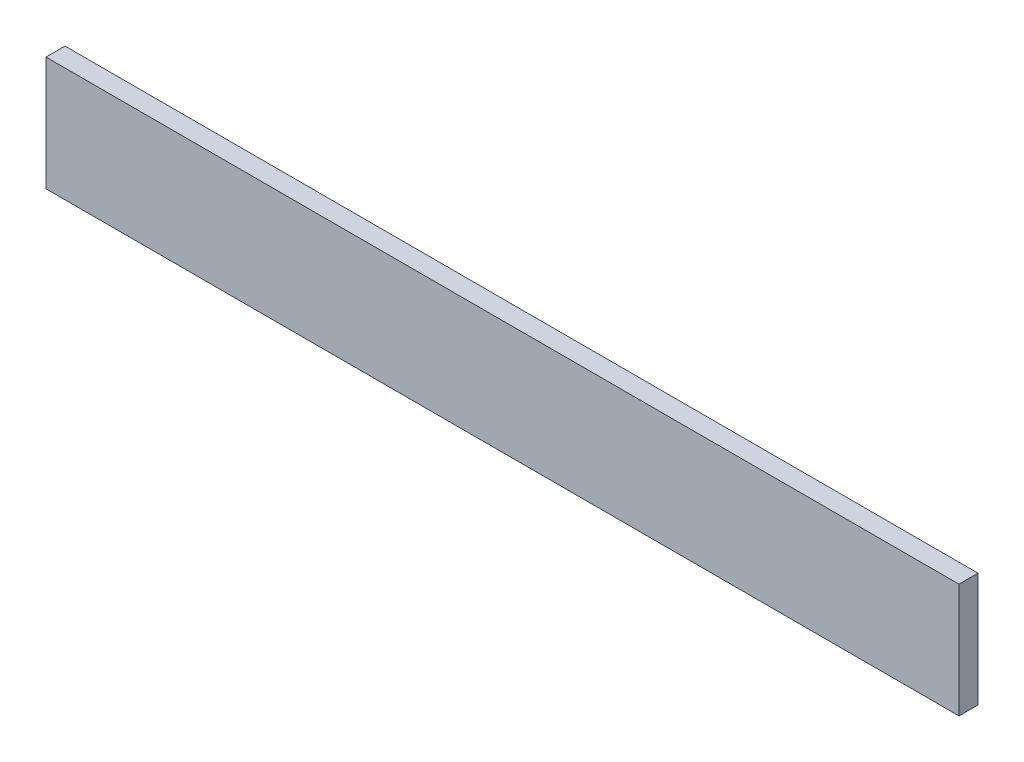
ISO-10303-21;
HEADER;
FILE_DESCRIPTION(('STEP AP214'),'2;1');
FILE_NAME('part.step','',(''),(''),'','','');
FILE_SCHEMA(('AUTOMOTIVE_DESIGN { 1 0 10303 214 1 1 1 1 }'));
ENDSEC;
DATA;
#1=APPLICATION_CONTEXT('core data for automotive mechanical design processes');
#2=APPLICATION_PROTOCOL_DEFINITION('international standard','automotive_design',2000,#1);
#3=PRODUCT_CONTEXT('',#1,'mechanical');
#4=PRODUCT('Part','Part','',(#3));
#5=PRODUCT_RELATED_PRODUCT_CATEGORY('part','',(#4));
#6=PRODUCT_DEFINITION_FORMATION('','',#4);
#7=PRODUCT_DEFINITION_CONTEXT('part definition',#1,'design');
#8=PRODUCT_DEFINITION('design','',#6,#7);
#9=PRODUCT_DEFINITION_SHAPE('','',#8);
#10=(LENGTH_UNIT() NAMED_UNIT(*) SI_UNIT(.MILLI.,.METRE.));
#11=(NAMED_UNIT(*) PLANE_ANGLE_UNIT() SI_UNIT($,.RADIAN.));
#12=(NAMED_UNIT(*) SI_UNIT($,.STERADIAN.) SOLID_ANGLE_UNIT());
#13=UNCERTAINTY_MEASURE_WITH_UNIT(LENGTH_MEASURE(1.E-05),#10,'distance_accuracy_value','');
#14=(GEOMETRIC_REPRESENTATION_CONTEXT(3) GLOBAL_UNCERTAINTY_ASSIGNED_CONTEXT((#13)) GLOBAL_UNIT_ASSIGNED_CONTEXT((#10,
#11,#12)) REPRESENTATION_CONTEXT('',''));
#15=CARTESIAN_POINT('',(0.,0.,0.));
#16=DIRECTION('',(0.,0.,1.));
#17=DIRECTION('',(1.,0.,0.));
#18=AXIS2_PLACEMENT_3D('',#15,#16,#17);
#19=CARTESIAN_POINT('',(0.,0.,6.35));
#20=DIRECTION('',(1.,0.,0.));
#21=DIRECTION('',(0.,0.,-1.));
#22=AXIS2_PLACEMENT_3D('',#19,#20,#21);
#23=PLANE('',#22);
#24=DIRECTION('',(0.,-1.,0.));
#25=VECTOR('',#24,1.);
#26=CARTESIAN_POINT('',(0.,0.,0.));
#27=LINE('',#26,#25);
#28=CARTESIAN_POINT('',(0.,38.1,0.));
#29=VERTEX_POINT('',#28);
#30=CARTESIAN_POINT('',(0.,0.,0.));
#31=VERTEX_POINT('',#30);
#32=EDGE_CURVE('E96',#29,#31,#27,.T.);
#33=ORIENTED_EDGE('',*,*,#32,.T.);
#34=DIRECTION('',(0.,0.,-1.));
#35=VECTOR('',#34,1.);
#36=CARTESIAN_POINT('',(0.,0.,6.35));
#37=LINE('',#36,#35);
#38=CARTESIAN_POINT('',(0.,0.,6.35));
#39=VERTEX_POINT('',#38);
#40=EDGE_CURVE('E11',#39,#31,#37,.T.);
#41=ORIENTED_EDGE('',*,*,#40,.F.);
#42=DIRECTION('',(0.,-1.,0.));
#43=VECTOR('',#42,1.);
#44=CARTESIAN_POINT('',(0.,0.,6.35));
#45=LINE('',#44,#43);
#46=CARTESIAN_POINT('',(0.,38.1,6.35));
#47=VERTEX_POINT('',#46);
#48=EDGE_CURVE('E84',#47,#39,#45,.T.);
#49=ORIENTED_EDGE('',*,*,#48,.F.);
#50=DIRECTION('',(0.,0.,-1.));
#51=VECTOR('',#50,1.);
#52=CARTESIAN_POINT('',(0.,38.1,6.35));
#53=LINE('',#52,#51);
#54=EDGE_CURVE('E92',#47,#29,#53,.T.);
#55=ORIENTED_EDGE('',*,*,#54,.T.);
#56=EDGE_LOOP('',(#33,#41,#49,#55));
#57=FACE_BOUND('',#56,.T.);
#58=ADVANCED_FACE('F33',(#57),#23,.F.);
#59=CARTESIAN_POINT('',(0.,0.,6.35));
#60=DIRECTION('',(0.,1.,0.));
#61=DIRECTION('',(0.,0.,1.));
#62=AXIS2_PLACEMENT_3D('',#59,#60,#61);
#63=PLANE('',#62);
#64=DIRECTION('',(1.,0.,0.));
#65=VECTOR('',#64,1.);
#66=CARTESIAN_POINT('',(0.,0.,0.));
#67=LINE('',#66,#65);
#68=CARTESIAN_POINT('',(304.8,0.,0.));
#69=VERTEX_POINT('',#68);
#70=EDGE_CURVE('E88',#31,#69,#67,.T.);
#71=ORIENTED_EDGE('',*,*,#70,.T.);
#72=DIRECTION('',(0.,0.,-1.));
#73=VECTOR('',#72,1.);
#74=CARTESIAN_POINT('',(304.8,0.,6.35));
#75=LINE('',#74,#73);
#76=CARTESIAN_POINT('',(304.8,0.,6.35));
#77=VERTEX_POINT('',#76);
#78=EDGE_CURVE('E41',#77,#69,#75,.T.);
#79=ORIENTED_EDGE('',*,*,#78,.F.);
#80=DIRECTION('',(1.,0.,0.));
#81=VECTOR('',#80,1.);
#82=CARTESIAN_POINT('',(0.,0.,6.35));
#83=LINE('',#82,#81);
#84=EDGE_CURVE('E79',#39,#77,#83,.T.);
#85=ORIENTED_EDGE('',*,*,#84,.F.);
#86=ORIENTED_EDGE('',*,*,#40,.T.);
#87=EDGE_LOOP('',(#71,#79,#85,#86));
#88=FACE_BOUND('',#87,.T.);
#89=ADVANCED_FACE('F87',(#88),#63,.F.);
#90=CARTESIAN_POINT('',(304.8,0.,6.35));
#91=DIRECTION('',(-1.,0.,0.));
#92=DIRECTION('',(0.,0.,1.));
#93=AXIS2_PLACEMENT_3D('',#90,#91,#92);
#94=PLANE('',#93);
#95=DIRECTION('',(0.,1.,0.));
#96=VECTOR('',#95,1.);
#97=CARTESIAN_POINT('',(304.8,0.,0.));
#98=LINE('',#97,#96);
#99=CARTESIAN_POINT('',(304.8,38.1,0.));
#100=VERTEX_POINT('',#99);
#101=EDGE_CURVE('E66',#69,#100,#98,.T.);
#102=ORIENTED_EDGE('',*,*,#101,.T.);
#103=DIRECTION('',(0.,0.,-1.));
#104=VECTOR('',#103,1.);
#105=CARTESIAN_POINT('',(304.8,38.1,6.35));
#106=LINE('',#105,#104);
#107=CARTESIAN_POINT('',(304.8,38.1,6.35));
#108=VERTEX_POINT('',#107);
#109=EDGE_CURVE('E89',#108,#100,#106,.T.);
#110=ORIENTED_EDGE('',*,*,#109,.F.);
#111=DIRECTION('',(0.,1.,0.));
#112=VECTOR('',#111,1.);
#113=CARTESIAN_POINT('',(304.8,0.,6.35));
#114=LINE('',#113,#112);
#115=EDGE_CURVE('E82',#77,#108,#114,.T.);
#116=ORIENTED_EDGE('',*,*,#115,.F.);
#117=ORIENTED_EDGE('',*,*,#78,.T.);
#118=EDGE_LOOP('',(#102,#110,#116,#117));
#119=FACE_BOUND('',#118,.T.);
#120=ADVANCED_FACE('F90',(#119),#94,.F.);
#121=CARTESIAN_POINT('',(0.,38.1,6.35));
#122=DIRECTION('',(0.,-1.,0.));
#123=DIRECTION('',(0.,0.,-1.));
#124=AXIS2_PLACEMENT_3D('',#121,#122,#123);
#125=PLANE('',#124);
#126=DIRECTION('',(-1.,0.,0.));
#127=VECTOR('',#126,1.);
#128=CARTESIAN_POINT('',(0.,38.1,0.));
#129=LINE('',#128,#127);
#130=EDGE_CURVE('E72',#100,#29,#129,.T.);
#131=ORIENTED_EDGE('',*,*,#130,.T.);
#132=ORIENTED_EDGE('',*,*,#54,.F.);
#133=DIRECTION('',(-1.,0.,0.));
#134=VECTOR('',#133,1.);
#135=CARTESIAN_POINT('',(0.,38.1,6.35));
#136=LINE('',#135,#134);
#137=EDGE_CURVE('E49',#108,#47,#136,.T.);
#138=ORIENTED_EDGE('',*,*,#137,.F.);
#139=ORIENTED_EDGE('',*,*,#109,.T.);
#140=EDGE_LOOP('',(#131,#132,#138,#139));
#141=FACE_BOUND('',#140,.T.);
#142=ADVANCED_FACE('F103',(#141),#125,.F.);
#143=CARTESIAN_POINT('',(0.,0.,6.35));
#144=DIRECTION('',(0.,0.,-1.));
#145=DIRECTION('',(-1.,0.,0.));
#146=AXIS2_PLACEMENT_3D('',#143,#144,#145);
#147=PLANE('',#146);
#148=ORIENTED_EDGE('',*,*,#48,.T.);
#149=ORIENTED_EDGE('',*,*,#84,.T.);
#150=ORIENTED_EDGE('',*,*,#115,.T.);
#151=ORIENTED_EDGE('',*,*,#137,.T.);
#152=EDGE_LOOP('',(#148,#149,#150,#151));
#153=FACE_BOUND('',#152,.T.);
#154=ADVANCED_FACE('F80',(#153),#147,.F.);
#155=CARTESIAN_POINT('',(0.,0.,0.));
#156=DIRECTION('',(0.,0.,-1.));
#157=DIRECTION('',(-1.,0.,0.));
#158=AXIS2_PLACEMENT_3D('',#155,#156,#157);
#159=PLANE('',#158);
#160=ORIENTED_EDGE('',*,*,#32,.F.);
#161=ORIENTED_EDGE('',*,*,#130,.F.);
#162=ORIENTED_EDGE('',*,*,#101,.F.);
#163=ORIENTED_EDGE('',*,*,#70,.F.);
#164=EDGE_LOOP('',(#160,#161,#162,#163));
#165=FACE_BOUND('',#164,.T.);
#166=ADVANCED_FACE('F106',(#165),#159,.T.);
#167=CLOSED_SHELL('',(#58,#89,#120,#142,#154,#166));
#168=MANIFOLD_SOLID_BREP('B2',#167);
#169=ADVANCED_BREP_SHAPE_REPRESENTATION('',(#18,#168),#14);
#170=SHAPE_DEFINITION_REPRESENTATION(#9,#169);
ENDSEC;
END-ISO-10303-21;
